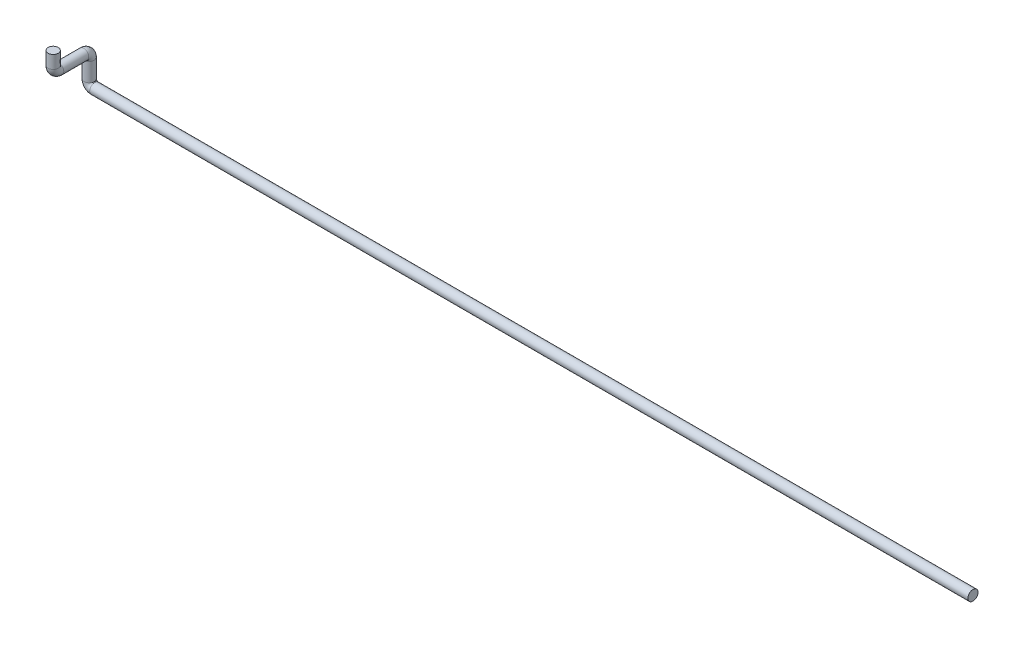
ISO-10303-21;
HEADER;
FILE_DESCRIPTION(('STEP AP214'),'2;1');
FILE_NAME('part.step','',(''),(''),'','','');
FILE_SCHEMA(('AUTOMOTIVE_DESIGN { 1 0 10303 214 1 1 1 1 }'));
ENDSEC;
DATA;
#1=APPLICATION_CONTEXT('core data for automotive mechanical design processes');
#2=APPLICATION_PROTOCOL_DEFINITION('international standard','automotive_design',2000,#1);
#3=PRODUCT_CONTEXT('',#1,'mechanical');
#4=PRODUCT('Part','Part','',(#3));
#5=PRODUCT_RELATED_PRODUCT_CATEGORY('part','',(#4));
#6=PRODUCT_DEFINITION_FORMATION('','',#4);
#7=PRODUCT_DEFINITION_CONTEXT('part definition',#1,'design');
#8=PRODUCT_DEFINITION('design','',#6,#7);
#9=PRODUCT_DEFINITION_SHAPE('','',#8);
#10=(LENGTH_UNIT() NAMED_UNIT(*) SI_UNIT(.MILLI.,.METRE.));
#11=(NAMED_UNIT(*) PLANE_ANGLE_UNIT() SI_UNIT($,.RADIAN.));
#12=(NAMED_UNIT(*) SI_UNIT($,.STERADIAN.) SOLID_ANGLE_UNIT());
#13=UNCERTAINTY_MEASURE_WITH_UNIT(LENGTH_MEASURE(1.E-05),#10,'distance_accuracy_value','');
#14=(GEOMETRIC_REPRESENTATION_CONTEXT(3) GLOBAL_UNCERTAINTY_ASSIGNED_CONTEXT((#13)) GLOBAL_UNIT_ASSIGNED_CONTEXT((#10,
#11,#12)) REPRESENTATION_CONTEXT('',''));
#15=CARTESIAN_POINT('',(0.,0.,0.));
#16=DIRECTION('',(0.,0.,1.));
#17=DIRECTION('',(1.,0.,0.));
#18=AXIS2_PLACEMENT_3D('',#15,#16,#17);
#19=CARTESIAN_POINT('',(0.,0.,0.));
#20=DIRECTION('',(1.,0.,0.));
#21=DIRECTION('',(0.,0.,-1.));
#22=AXIS2_PLACEMENT_3D('',#19,#20,#21);
#23=PLANE('',#22);
#24=CARTESIAN_POINT('',(0.,0.,0.));
#25=DIRECTION('',(1.,0.,0.));
#26=DIRECTION('',(0.,0.,-1.));
#27=AXIS2_PLACEMENT_3D('',#24,#25,#26);
#28=CIRCLE('',#27,13.7);
#29=CARTESIAN_POINT('',(0.,0.,-13.7));
#30=VERTEX_POINT('',#29);
#31=EDGE_CURVE('E47',#30,#30,#28,.T.);
#32=ORIENTED_EDGE('',*,*,#31,.T.);
#33=EDGE_LOOP('',(#32));
#34=FACE_BOUND('',#33,.T.);
#35=ADVANCED_FACE('F35',(#34),#23,.T.);
#36=CARTESIAN_POINT('',(-2389.,130.,97.5));
#37=DIRECTION('',(0.,-1.,0.));
#38=DIRECTION('',(0.,0.,-1.));
#39=AXIS2_PLACEMENT_3D('',#36,#37,#38);
#40=PLANE('',#39);
#41=CARTESIAN_POINT('',(-2389.,130.,97.5));
#42=DIRECTION('',(0.,-1.,0.));
#43=DIRECTION('',(0.,0.,-1.));
#44=AXIS2_PLACEMENT_3D('',#41,#42,#43);
#45=CIRCLE('',#44,13.7);
#46=CARTESIAN_POINT('',(-2389.,130.,83.8));
#47=VERTEX_POINT('',#46);
#48=EDGE_CURVE('E11',#47,#47,#45,.T.);
#49=ORIENTED_EDGE('',*,*,#48,.F.);
#50=EDGE_LOOP('',(#49));
#51=FACE_BOUND('',#50,.T.);
#52=ADVANCED_FACE('F53',(#51),#40,.F.);
#53=CARTESIAN_POINT('',(0.,0.,0.));
#54=DIRECTION('',(-1.,0.,0.));
#55=DIRECTION('',(0.,0.,1.));
#56=AXIS2_PLACEMENT_3D('',#53,#54,#55);
#57=CYLINDRICAL_SURFACE('',#56,13.7);
#58=CARTESIAN_POINT('',(-2374.,0.,0.));
#59=DIRECTION('',(1.,0.,0.));
#60=DIRECTION('',(0.,0.,-1.));
#61=AXIS2_PLACEMENT_3D('',#58,#59,#60);
#62=CIRCLE('',#61,13.7);
#63=CARTESIAN_POINT('',(-2374.,-13.7000000000001,0.));
#64=VERTEX_POINT('',#63);
#65=EDGE_CURVE('E95',#64,#64,#62,.T.);
#66=ORIENTED_EDGE('',*,*,#65,.T.);
#67=EDGE_LOOP('',(#66));
#68=FACE_BOUND('',#67,.T.);
#69=ORIENTED_EDGE('',*,*,#31,.F.);
#70=EDGE_LOOP('',(#69));
#71=FACE_BOUND('',#70,.T.);
#72=ADVANCED_FACE('F55',(#68,#71),#57,.T.);
#73=CARTESIAN_POINT('',(-2374.,15.,0.));
#74=DIRECTION('',(0.,0.,-1.));
#75=DIRECTION('',(-1.,0.,0.));
#76=AXIS2_PLACEMENT_3D('',#73,#74,#75);
#77=TOROIDAL_SURFACE('',#76,15.0000000000001,13.7);
#78=CARTESIAN_POINT('',(-2389.,15.,0.));
#79=DIRECTION('',(0.,-1.,0.));
#80=DIRECTION('',(0.,0.,-1.));
#81=AXIS2_PLACEMENT_3D('',#78,#79,#80);
#82=CIRCLE('',#81,13.7);
#83=CARTESIAN_POINT('',(-2402.7,15.,0.));
#84=VERTEX_POINT('',#83);
#85=EDGE_CURVE('E92',#84,#84,#82,.T.);
#86=CARTESIAN_POINT('',(-2374.,15.,0.));
#87=DIRECTION('',(0.,0.,-1.));
#88=DIRECTION('',(-1.,0.,0.));
#89=AXIS2_PLACEMENT_3D('',#86,#87,#88);
#90=CIRCLE('',#89,28.7000000000001);
#91=EDGE_CURVE('',#64,#84,#90,.T.);
#92=ORIENTED_EDGE('',*,*,#65,.F.);
#93=ORIENTED_EDGE('',*,*,#85,.T.);
#94=ORIENTED_EDGE('',*,*,#91,.T.);
#95=ORIENTED_EDGE('',*,*,#91,.F.);
#96=EDGE_LOOP('',(#92,#94,#93,#95));
#97=FACE_BOUND('',#96,.T.);
#98=ADVANCED_FACE('F60',(#97),#77,.T.);
#99=CARTESIAN_POINT('',(-2389.,15.,0.));
#100=DIRECTION('',(0.,1.,0.));
#101=DIRECTION('',(0.,0.,1.));
#102=AXIS2_PLACEMENT_3D('',#99,#100,#101);
#103=CYLINDRICAL_SURFACE('',#102,13.7);
#104=CARTESIAN_POINT('',(-2389.,65.,0.));
#105=DIRECTION('',(0.,-1.,0.));
#106=DIRECTION('',(0.,0.,-1.));
#107=AXIS2_PLACEMENT_3D('',#104,#105,#106);
#108=CIRCLE('',#107,13.7);
#109=CARTESIAN_POINT('',(-2389.,65.,-13.7));
#110=VERTEX_POINT('',#109);
#111=EDGE_CURVE('E97',#110,#110,#108,.T.);
#112=ORIENTED_EDGE('',*,*,#111,.T.);
#113=EDGE_LOOP('',(#112));
#114=FACE_BOUND('',#113,.T.);
#115=ORIENTED_EDGE('',*,*,#85,.F.);
#116=EDGE_LOOP('',(#115));
#117=FACE_BOUND('',#116,.T.);
#118=ADVANCED_FACE('F80',(#114,#117),#103,.T.);
#119=CARTESIAN_POINT('',(-2389.,65.,15.));
#120=DIRECTION('',(1.,0.,0.));
#121=DIRECTION('',(0.,0.,-1.));
#122=AXIS2_PLACEMENT_3D('',#119,#120,#121);
#123=TOROIDAL_SURFACE('',#122,15.,13.7);
#124=CARTESIAN_POINT('',(-2389.,80.,15.));
#125=DIRECTION('',(0.,0.,-1.));
#126=DIRECTION('',(0.,1.,0.));
#127=AXIS2_PLACEMENT_3D('',#124,#125,#126);
#128=CIRCLE('',#127,13.7);
#129=CARTESIAN_POINT('',(-2389.,93.7,15.));
#130=VERTEX_POINT('',#129);
#131=EDGE_CURVE('E103',#130,#130,#128,.T.);
#132=CARTESIAN_POINT('',(-2389.,65.,15.));
#133=DIRECTION('',(1.,0.,0.));
#134=DIRECTION('',(0.,0.,-1.));
#135=AXIS2_PLACEMENT_3D('',#132,#133,#134);
#136=CIRCLE('',#135,28.7);
#137=EDGE_CURVE('',#110,#130,#136,.T.);
#138=ORIENTED_EDGE('',*,*,#111,.F.);
#139=ORIENTED_EDGE('',*,*,#131,.T.);
#140=ORIENTED_EDGE('',*,*,#137,.T.);
#141=ORIENTED_EDGE('',*,*,#137,.F.);
#142=EDGE_LOOP('',(#138,#140,#139,#141));
#143=FACE_BOUND('',#142,.T.);
#144=ADVANCED_FACE('F76',(#143),#123,.T.);
#145=CARTESIAN_POINT('',(-2389.,80.,15.));
#146=DIRECTION('',(0.,0.,1.));
#147=DIRECTION('',(1.,0.,0.));
#148=AXIS2_PLACEMENT_3D('',#145,#146,#147);
#149=CYLINDRICAL_SURFACE('',#148,13.7);
#150=CARTESIAN_POINT('',(-2389.,80.,82.5));
#151=DIRECTION('',(0.,0.,-1.));
#152=DIRECTION('',(0.,1.,0.));
#153=AXIS2_PLACEMENT_3D('',#150,#151,#152);
#154=CIRCLE('',#153,13.7);
#155=CARTESIAN_POINT('',(-2389.,66.3,82.5));
#156=VERTEX_POINT('',#155);
#157=EDGE_CURVE('E106',#156,#156,#154,.T.);
#158=ORIENTED_EDGE('',*,*,#157,.T.);
#159=EDGE_LOOP('',(#158));
#160=FACE_BOUND('',#159,.T.);
#161=ORIENTED_EDGE('',*,*,#131,.F.);
#162=EDGE_LOOP('',(#161));
#163=FACE_BOUND('',#162,.T.);
#164=ADVANCED_FACE('F70',(#160,#163),#149,.T.);
#165=CARTESIAN_POINT('',(-2389.,95.,82.5));
#166=DIRECTION('',(-1.,0.,0.));
#167=DIRECTION('',(0.,0.,1.));
#168=AXIS2_PLACEMENT_3D('',#165,#166,#167);
#169=TOROIDAL_SURFACE('',#168,15.,13.7);
#170=CARTESIAN_POINT('',(-2389.,95.,97.5));
#171=DIRECTION('',(0.,-1.,0.));
#172=DIRECTION('',(0.,0.,-1.));
#173=AXIS2_PLACEMENT_3D('',#170,#171,#172);
#174=CIRCLE('',#173,13.7);
#175=CARTESIAN_POINT('',(-2389.,95.,111.2));
#176=VERTEX_POINT('',#175);
#177=EDGE_CURVE('E42',#176,#176,#174,.T.);
#178=CARTESIAN_POINT('',(-2389.,95.,82.5));
#179=DIRECTION('',(-1.,0.,0.));
#180=DIRECTION('',(0.,0.,1.));
#181=AXIS2_PLACEMENT_3D('',#178,#179,#180);
#182=CIRCLE('',#181,28.7);
#183=EDGE_CURVE('',#156,#176,#182,.T.);
#184=ORIENTED_EDGE('',*,*,#157,.F.);
#185=ORIENTED_EDGE('',*,*,#177,.T.);
#186=ORIENTED_EDGE('',*,*,#183,.T.);
#187=ORIENTED_EDGE('',*,*,#183,.F.);
#188=EDGE_LOOP('',(#184,#186,#185,#187));
#189=FACE_BOUND('',#188,.T.);
#190=ADVANCED_FACE('F66',(#189),#169,.T.);
#191=CARTESIAN_POINT('',(-2389.,95.,97.5));
#192=DIRECTION('',(0.,1.,0.));
#193=DIRECTION('',(0.,0.,1.));
#194=AXIS2_PLACEMENT_3D('',#191,#192,#193);
#195=CYLINDRICAL_SURFACE('',#194,13.7);
#196=ORIENTED_EDGE('',*,*,#48,.T.);
#197=EDGE_LOOP('',(#196));
#198=FACE_BOUND('',#197,.T.);
#199=ORIENTED_EDGE('',*,*,#177,.F.);
#200=EDGE_LOOP('',(#199));
#201=FACE_BOUND('',#200,.T.);
#202=ADVANCED_FACE('F50',(#198,#201),#195,.T.);
#203=CLOSED_SHELL('',(#35,#52,#72,#98,#118,#144,#164,#190,#202));
#204=MANIFOLD_SOLID_BREP('B2',#203);
#205=ADVANCED_BREP_SHAPE_REPRESENTATION('',(#18,#204),#14);
#206=SHAPE_DEFINITION_REPRESENTATION(#9,#205);
ENDSEC;
END-ISO-10303-21;
